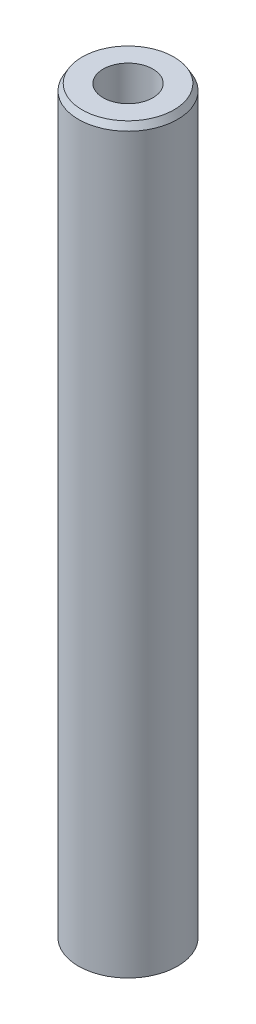
ISO-10303-21;
HEADER;
FILE_DESCRIPTION(('STEP AP214'),'2;1');
FILE_NAME('part.step','',(''),(''),'','','');
FILE_SCHEMA(('AUTOMOTIVE_DESIGN { 1 0 10303 214 1 1 1 1 }'));
ENDSEC;
DATA;
#1=APPLICATION_CONTEXT('core data for automotive mechanical design processes');
#2=APPLICATION_PROTOCOL_DEFINITION('international standard','automotive_design',2000,#1);
#3=PRODUCT_CONTEXT('',#1,'mechanical');
#4=PRODUCT('Part','Part','',(#3));
#5=PRODUCT_RELATED_PRODUCT_CATEGORY('part','',(#4));
#6=PRODUCT_DEFINITION_FORMATION('','',#4);
#7=PRODUCT_DEFINITION_CONTEXT('part definition',#1,'design');
#8=PRODUCT_DEFINITION('design','',#6,#7);
#9=PRODUCT_DEFINITION_SHAPE('','',#8);
#10=(LENGTH_UNIT() NAMED_UNIT(*) SI_UNIT(.MILLI.,.METRE.));
#11=(NAMED_UNIT(*) PLANE_ANGLE_UNIT() SI_UNIT($,.RADIAN.));
#12=(NAMED_UNIT(*) SI_UNIT($,.STERADIAN.) SOLID_ANGLE_UNIT());
#13=UNCERTAINTY_MEASURE_WITH_UNIT(LENGTH_MEASURE(1.E-05),#10,'distance_accuracy_value','');
#14=(GEOMETRIC_REPRESENTATION_CONTEXT(3) GLOBAL_UNCERTAINTY_ASSIGNED_CONTEXT((#13)) GLOBAL_UNIT_ASSIGNED_CONTEXT((#10,
#11,#12)) REPRESENTATION_CONTEXT('',''));
#15=CARTESIAN_POINT('',(0.,0.,0.));
#16=DIRECTION('',(0.,0.,1.));
#17=DIRECTION('',(1.,0.,0.));
#18=AXIS2_PLACEMENT_3D('',#15,#16,#17);
#19=CARTESIAN_POINT('',(0.,600.,0.));
#20=DIRECTION('',(0.,-1.,0.));
#21=DIRECTION('',(0.,0.,-1.));
#22=AXIS2_PLACEMENT_3D('',#19,#20,#21);
#23=CYLINDRICAL_SURFACE('',#22,40.);
#24=CARTESIAN_POINT('',(0.,594.836515759471,0.));
#25=DIRECTION('',(0.,1.,0.));
#26=DIRECTION('',(0.,0.,1.));
#27=AXIS2_PLACEMENT_3D('',#24,#25,#26);
#28=CIRCLE('',#27,40.);
#29=CARTESIAN_POINT('',(0.,594.836515759471,-40.));
#30=VERTEX_POINT('',#29);
#31=EDGE_CURVE('E50',#30,#30,#28,.F.);
#32=CARTESIAN_POINT('',(0.,2.98113901622554,0.));
#33=DIRECTION('',(0.,1.,0.));
#34=DIRECTION('',(0.,0.,1.));
#35=AXIS2_PLACEMENT_3D('',#32,#33,#34);
#36=CIRCLE('',#35,40.);
#37=CARTESIAN_POINT('',(0.,2.98113901622543,-40.));
#38=VERTEX_POINT('',#37);
#39=EDGE_CURVE('E51',#38,#38,#36,.T.);
#40=CARTESIAN_POINT('',(0.,594.836515759471,-40.));
#41=CARTESIAN_POINT('',(0.,588.671355585063,-40.));
#42=CARTESIAN_POINT('',(0.,582.506195410654,-40.));
#43=CARTESIAN_POINT('',(0.,570.175875061836,-40.));
#44=CARTESIAN_POINT('',(0.,564.010714887427,-40.));
#45=CARTESIAN_POINT('',(0.,551.68039453861,-40.));
#46=CARTESIAN_POINT('',(0.,545.515234364201,-40.));
#47=CARTESIAN_POINT('',(0.,533.184914015383,-40.));
#48=CARTESIAN_POINT('',(0.,527.019753840975,-40.));
#49=CARTESIAN_POINT('',(0.,514.689433492157,-40.));
#50=CARTESIAN_POINT('',(0.,508.524273317748,-40.));
#51=CARTESIAN_POINT('',(0.,496.19395296893,-40.));
#52=CARTESIAN_POINT('',(0.,490.028792794522,-40.));
#53=CARTESIAN_POINT('',(0.,477.698472445704,-40.));
#54=CARTESIAN_POINT('',(0.,471.533312271295,-40.));
#55=CARTESIAN_POINT('',(0.,459.202991922478,-40.));
#56=CARTESIAN_POINT('',(0.,453.037831748069,-40.));
#57=CARTESIAN_POINT('',(0.,440.707511399251,-40.));
#58=CARTESIAN_POINT('',(0.,434.542351224842,-40.));
#59=CARTESIAN_POINT('',(0.,422.212030876025,-40.));
#60=CARTESIAN_POINT('',(0.,416.046870701616,-40.));
#61=CARTESIAN_POINT('',(0.,403.716550352798,-40.));
#62=CARTESIAN_POINT('',(0.,397.551390178389,-40.));
#63=CARTESIAN_POINT('',(0.,385.221069829572,-40.));
#64=CARTESIAN_POINT('',(0.,379.055909655163,-40.));
#65=CARTESIAN_POINT('',(0.,366.725589306345,-40.));
#66=CARTESIAN_POINT('',(0.,360.560429131937,-40.));
#67=CARTESIAN_POINT('',(0.,348.230108783119,-40.));
#68=CARTESIAN_POINT('',(0.,342.06494860871,-40.));
#69=CARTESIAN_POINT('',(0.,329.734628259893,-40.));
#70=CARTESIAN_POINT('',(0.,323.569468085484,-40.));
#71=CARTESIAN_POINT('',(0.,311.239147736666,-40.));
#72=CARTESIAN_POINT('',(0.,305.073987562257,-40.));
#73=CARTESIAN_POINT('',(0.,292.74366721344,-40.));
#74=CARTESIAN_POINT('',(0.,286.578507039031,-40.));
#75=CARTESIAN_POINT('',(0.,274.248186690213,-40.));
#76=CARTESIAN_POINT('',(0.,268.083026515804,-40.));
#77=CARTESIAN_POINT('',(0.,255.752706166987,-40.));
#78=CARTESIAN_POINT('',(0.,249.587545992578,-40.));
#79=CARTESIAN_POINT('',(0.,237.25722564376,-40.));
#80=CARTESIAN_POINT('',(0.,231.092065469352,-40.));
#81=CARTESIAN_POINT('',(0.,218.761745120534,-40.));
#82=CARTESIAN_POINT('',(0.,212.596584946125,-40.));
#83=CARTESIAN_POINT('',(0.,200.266264597307,-40.));
#84=CARTESIAN_POINT('',(0.,194.101104422899,-40.));
#85=CARTESIAN_POINT('',(0.,181.770784074081,-40.));
#86=CARTESIAN_POINT('',(0.,175.605623899672,-40.));
#87=CARTESIAN_POINT('',(0.,163.275303550855,-40.));
#88=CARTESIAN_POINT('',(0.,157.110143376446,-40.));
#89=CARTESIAN_POINT('',(0.,144.779823027628,-40.));
#90=CARTESIAN_POINT('',(0.,138.614662853219,-40.));
#91=CARTESIAN_POINT('',(0.,126.284342504402,-40.));
#92=CARTESIAN_POINT('',(0.,120.119182329993,-40.));
#93=CARTESIAN_POINT('',(0.,107.788861981175,-40.));
#94=CARTESIAN_POINT('',(0.,101.623701806766,-40.));
#95=CARTESIAN_POINT('',(0.,89.2933814579489,-40.));
#96=CARTESIAN_POINT('',(0.,83.1282212835401,-40.));
#97=CARTESIAN_POINT('',(0.,70.7979009347225,-40.));
#98=CARTESIAN_POINT('',(0.,64.6327407603137,-40.));
#99=CARTESIAN_POINT('',(0.,52.302420411496,-40.));
#100=CARTESIAN_POINT('',(0.,46.1372602370872,-40.));
#101=CARTESIAN_POINT('',(0.,33.8069398882695,-40.));
#102=CARTESIAN_POINT('',(0.,27.6417797138607,-40.));
#103=CARTESIAN_POINT('',(0.,15.3114593650431,-40.));
#104=CARTESIAN_POINT('',(0.,9.14629919063425,-40.));
#105=CARTESIAN_POINT('',(0.,2.98113901622543,-40.));
#106=B_SPLINE_CURVE_WITH_KNOTS('',3,(#40,#41,#42,#43,#44,#45,#46,#47,#48,#49,#50,#51,#52,#53,
#54,#55,#56,#57,#58,#59,#60,#61,#62,#63,#64,#65,#66,#67,#68,#69,#70,#71,#72,#73,#74,#75,#76,#77,
#78,#79,#80,#81,#82,#83,#84,#85,#86,#87,#88,#89,#90,#91,#92,#93,#94,#95,#96,#97,#98,#99,#100,
#101,#102,#103,#104,#105),.UNSPECIFIED.,.F.,.F.,(4,2,2,2,2,2,2,2,2,2,2,2,2,2,2,2,2,2,2,2,2,2,2,
2,2,2,2,2,2,2,2,2,4),(0.,18.4954805232265,36.9909610464529,55.4864415696794,73.9819220929058,
92.4774026161322,110.972883139359,129.468363662585,147.963844185812,166.459324709038,
184.954805232264,203.450285755491,221.945766278717,240.441246801944,258.93672732517,
277.432207848397,295.927688371623,314.423168894849,332.918649418076,351.414129941302,
369.909610464529,388.405090987755,406.900571510982,425.396052034208,443.891532557435,
462.387013080661,480.882493603887,499.377974127114,517.87345465034,536.368935173567,
554.864415696793,573.35989622002,591.855376743246),.UNSPECIFIED.);
#107=EDGE_CURVE('BSEAM39',#30,#38,#106,.T.);
#108=ORIENTED_EDGE('',*,*,#31,.T.);
#109=ORIENTED_EDGE('',*,*,#39,.T.);
#110=ORIENTED_EDGE('',*,*,#107,.T.);
#111=ORIENTED_EDGE('',*,*,#107,.F.);
#112=EDGE_LOOP('',(#108,#110,#109,#111));
#113=FACE_BOUND('',#112,.T.);
#114=ADVANCED_FACE('F39',(#113),#23,.T.);
#115=CARTESIAN_POINT('',(0.,600.,0.));
#116=DIRECTION('',(0.,1.,0.));
#117=DIRECTION('',(0.,0.,1.));
#118=AXIS2_PLACEMENT_3D('',#115,#116,#117);
#119=PLANE('',#118);
#120=CARTESIAN_POINT('',(0.,600.,0.));
#121=DIRECTION('',(0.,1.,0.));
#122=DIRECTION('',(0.,0.,1.));
#123=AXIS2_PLACEMENT_3D('',#120,#121,#122);
#124=CIRCLE('',#123,37.0188609837746);
#125=CARTESIAN_POINT('',(0.,600.,-37.0188609837746));
#126=VERTEX_POINT('',#125);
#127=EDGE_CURVE('E54',#126,#126,#124,.T.);
#128=ORIENTED_EDGE('',*,*,#127,.T.);
#129=EDGE_LOOP('',(#128));
#130=FACE_BOUND('',#129,.T.);
#131=CARTESIAN_POINT('',(0.,600.,0.));
#132=DIRECTION('',(0.,1.,0.));
#133=DIRECTION('',(0.,0.,1.));
#134=AXIS2_PLACEMENT_3D('',#131,#132,#133);
#135=CIRCLE('',#134,20.0903469490662);
#136=CARTESIAN_POINT('',(0.,600.,20.0903469490662));
#137=VERTEX_POINT('',#136);
#138=EDGE_CURVE('E58',#137,#137,#135,.T.);
#139=ORIENTED_EDGE('',*,*,#138,.F.);
#140=EDGE_LOOP('',(#139));
#141=FACE_BOUND('',#140,.T.);
#142=ADVANCED_FACE('F69',(#130,#141),#119,.T.);
#143=CARTESIAN_POINT('',(0.,0.,0.));
#144=DIRECTION('',(0.,1.,0.));
#145=DIRECTION('',(0.,0.,1.));
#146=AXIS2_PLACEMENT_3D('',#143,#144,#145);
#147=PLANE('',#146);
#148=CARTESIAN_POINT('',(0.,0.,0.));
#149=DIRECTION('',(0.,1.,0.));
#150=DIRECTION('',(0.,0.,1.));
#151=AXIS2_PLACEMENT_3D('',#148,#149,#150);
#152=CIRCLE('',#151,34.8365157594716);
#153=CARTESIAN_POINT('',(0.,0.,34.8365157594716));
#154=VERTEX_POINT('',#153);
#155=EDGE_CURVE('E10',#154,#154,#152,.F.);
#156=ORIENTED_EDGE('',*,*,#155,.T.);
#157=EDGE_LOOP('',(#156));
#158=FACE_BOUND('',#157,.T.);
#159=CARTESIAN_POINT('',(0.,0.,0.));
#160=DIRECTION('',(0.,1.,0.));
#161=DIRECTION('',(0.,0.,1.));
#162=AXIS2_PLACEMENT_3D('',#159,#160,#161);
#163=CIRCLE('',#162,20.0903469490662);
#164=CARTESIAN_POINT('',(0.,0.,20.0903469490662));
#165=VERTEX_POINT('',#164);
#166=EDGE_CURVE('E63',#165,#165,#163,.T.);
#167=ORIENTED_EDGE('',*,*,#166,.T.);
#168=EDGE_LOOP('',(#167));
#169=FACE_BOUND('',#168,.T.);
#170=ADVANCED_FACE('F75',(#158,#169),#147,.F.);
#171=CARTESIAN_POINT('',(0.,600.,0.));
#172=DIRECTION('',(0.,-1.,0.));
#173=DIRECTION('',(0.,0.,-1.));
#174=AXIS2_PLACEMENT_3D('',#171,#172,#173);
#175=CYLINDRICAL_SURFACE('',#174,20.0903469490662);
#176=ORIENTED_EDGE('',*,*,#138,.T.);
#177=EDGE_LOOP('',(#176));
#178=FACE_BOUND('',#177,.T.);
#179=ORIENTED_EDGE('',*,*,#166,.F.);
#180=EDGE_LOOP('',(#179));
#181=FACE_BOUND('',#180,.T.);
#182=ADVANCED_FACE('F70',(#178,#181),#175,.F.);
#183=CARTESIAN_POINT('',(0.,600.,0.));
#184=DIRECTION('',(0.,-1.,0.));
#185=DIRECTION('',(0.,0.,-1.));
#186=AXIS2_PLACEMENT_3D('',#183,#184,#185);
#187=CONICAL_SURFACE('',#186,37.0188609837746,0.52359877559829);
#188=CARTESIAN_POINT('',(0.,594.836515759471,-40.));
#189=CARTESIAN_POINT('',(0.,594.890302053644,-39.968946468581));
#190=CARTESIAN_POINT('',(0.,594.944088347816,-39.937892937162));
#191=CARTESIAN_POINT('',(0.,595.05166093616,-39.875785874324));
#192=CARTESIAN_POINT('',(0.,595.105447230332,-39.844732342905));
#193=CARTESIAN_POINT('',(0.,595.213019818677,-39.7826252800669));
#194=CARTESIAN_POINT('',(0.,595.266806112849,-39.7515717486479));
#195=CARTESIAN_POINT('',(0.,595.374378701193,-39.6894646858099));
#196=CARTESIAN_POINT('',(0.,595.428164995365,-39.6584111543909));
#197=CARTESIAN_POINT('',(0.,595.53573758371,-39.5963040915528));
#198=CARTESIAN_POINT('',(0.,595.589523877882,-39.5652505601338));
#199=CARTESIAN_POINT('',(0.,595.697096466226,-39.5031434972958));
#200=CARTESIAN_POINT('',(0.,595.750882760398,-39.4720899658768));
#201=CARTESIAN_POINT('',(0.,595.858455348743,-39.4099829030388));
#202=CARTESIAN_POINT('',(0.,595.912241642915,-39.3789293716197));
#203=CARTESIAN_POINT('',(0.,596.019814231259,-39.3168223087817));
#204=CARTESIAN_POINT('',(0.,596.073600525431,-39.2857687773627));
#205=CARTESIAN_POINT('',(0.,596.181173113776,-39.2236617145246));
#206=CARTESIAN_POINT('',(0.,596.234959407948,-39.1926081831056));
#207=CARTESIAN_POINT('',(0.,596.342531996292,-39.1305011202676));
#208=CARTESIAN_POINT('',(0.,596.396318290464,-39.0994475888486));
#209=CARTESIAN_POINT('',(0.,596.503890878809,-39.0373405260106));
#210=CARTESIAN_POINT('',(0.,596.557677172981,-39.0062869945915));
#211=CARTESIAN_POINT('',(0.,596.665249761325,-38.9441799317535));
#212=CARTESIAN_POINT('',(0.,596.719036055497,-38.9131264003345));
#213=CARTESIAN_POINT('',(0.,596.826608643842,-38.8510193374965));
#214=CARTESIAN_POINT('',(0.,596.880394938014,-38.8199658060775));
#215=CARTESIAN_POINT('',(0.,596.987967526358,-38.7578587432394));
#216=CARTESIAN_POINT('',(0.,597.041753820531,-38.7268052118204));
#217=CARTESIAN_POINT('',(0.,597.149326408875,-38.6646981489824));
#218=CARTESIAN_POINT('',(0.,597.203112703047,-38.6336446175634));
#219=CARTESIAN_POINT('',(0.,597.310685291391,-38.5715375547253));
#220=CARTESIAN_POINT('',(0.,597.364471585563,-38.5404840233063));
#221=CARTESIAN_POINT('',(0.,597.472044173908,-38.4783769604683));
#222=CARTESIAN_POINT('',(0.,597.52583046808,-38.4473234290493));
#223=CARTESIAN_POINT('',(0.,597.633403056424,-38.3852163662113));
#224=CARTESIAN_POINT('',(0.,597.687189350597,-38.3541628347922));
#225=CARTESIAN_POINT('',(0.,597.794761938941,-38.2920557719542));
#226=CARTESIAN_POINT('',(0.,597.848548233113,-38.2610022405352));
#227=CARTESIAN_POINT('',(0.,597.956120821457,-38.1988951776972));
#228=CARTESIAN_POINT('',(0.,598.00990711563,-38.1678416462781));
#229=CARTESIAN_POINT('',(0.,598.117479703974,-38.1057345834401));
#230=CARTESIAN_POINT('',(0.,598.171265998146,-38.0746810520211));
#231=CARTESIAN_POINT('',(0.,598.27883858649,-38.0125739891831));
#232=CARTESIAN_POINT('',(0.,598.332624880663,-37.9815204577641));
#233=CARTESIAN_POINT('',(0.,598.440197469007,-37.919413394926));
#234=CARTESIAN_POINT('',(0.,598.493983763179,-37.888359863507));
#235=CARTESIAN_POINT('',(0.,598.601556351523,-37.826252800669));
#236=CARTESIAN_POINT('',(0.,598.655342645696,-37.79519926925));
#237=CARTESIAN_POINT('',(0.,598.76291523404,-37.7330922064119));
#238=CARTESIAN_POINT('',(0.,598.816701528212,-37.7020386749929));
#239=CARTESIAN_POINT('',(0.,598.924274116556,-37.6399316121549));
#240=CARTESIAN_POINT('',(0.,598.978060410729,-37.6088780807359));
#241=CARTESIAN_POINT('',(0.,599.085632999073,-37.5467710178978));
#242=CARTESIAN_POINT('',(0.,599.139419293245,-37.5157174864788));
#243=CARTESIAN_POINT('',(0.,599.24699188159,-37.4536104236408));
#244=CARTESIAN_POINT('',(0.,599.300778175762,-37.4225568922218));
#245=CARTESIAN_POINT('',(0.,599.408350764106,-37.3604498293837));
#246=CARTESIAN_POINT('',(0.,599.462137058278,-37.3293962979647));
#247=CARTESIAN_POINT('',(0.,599.569709646623,-37.2672892351267));
#248=CARTESIAN_POINT('',(0.,599.623495940795,-37.2362357037077));
#249=CARTESIAN_POINT('',(0.,599.731068529139,-37.1741286408696));
#250=CARTESIAN_POINT('',(0.,599.784854823311,-37.1430751094506));
#251=CARTESIAN_POINT('',(0.,599.892427411656,-37.0809680466126));
#252=CARTESIAN_POINT('',(0.,599.946213705828,-37.0499145151936));
#253=CARTESIAN_POINT('',(0.,600.,-37.0188609837746));
#254=B_SPLINE_CURVE_WITH_KNOTS('',3,(#188,#189,#190,#191,#192,#193,#194,#195,#196,#197,#198,
#199,#200,#201,#202,#203,#204,#205,#206,#207,#208,#209,#210,#211,#212,#213,#214,#215,#216,#217,
#218,#219,#220,#221,#222,#223,#224,#225,#226,#227,#228,#229,#230,#231,#232,#233,#234,#235,#236,
#237,#238,#239,#240,#241,#242,#243,#244,#245,#246,#247,#248,#249,#250,#251,#252,#253),
.UNSPECIFIED.,.F.,.F.,(4,2,2,2,2,2,2,2,2,2,2,2,2,2,2,2,2,2,2,2,2,2,2,2,2,2,2,2,2,2,2,2,4),(0.,
0.186321188514134,0.372642377028264,0.558963565542302,0.745284754056436,0.93160594257047,
1.1179271310846,1.30424831959873,1.49056950811277,1.67689069662691,1.86321188514094,
2.04953307365507,2.23585426216921,2.42217545068324,2.60849663919738,2.79481782771141,
2.98113901622555,3.16746020473968,3.35378139325371,3.54010258176785,3.72642377028188,
3.91274495879602,4.09906614731015,4.28538733582418,4.47170852433832,4.65802971285235,
4.84435090136649,5.03067208988062,5.21699327839465,5.40331446690879,5.58963565542282,
5.77595684393695,5.96227803245108),.UNSPECIFIED.);
#255=EDGE_CURVE('BSEAM81',#30,#126,#254,.T.);
#256=ORIENTED_EDGE('',*,*,#31,.F.);
#257=ORIENTED_EDGE('',*,*,#127,.F.);
#258=ORIENTED_EDGE('',*,*,#255,.T.);
#259=ORIENTED_EDGE('',*,*,#255,.F.);
#260=EDGE_LOOP('',(#256,#258,#257,#259));
#261=FACE_BOUND('',#260,.T.);
#262=ADVANCED_FACE('F81',(#261),#187,.T.);
#263=CARTESIAN_POINT('',(0.,2.98113901622554,0.));
#264=DIRECTION('',(0.,1.,0.));
#265=DIRECTION('',(0.,0.,1.));
#266=AXIS2_PLACEMENT_3D('',#263,#264,#265);
#267=CONICAL_SURFACE('',#266,40.,1.04719755119659);
#268=ORIENTED_EDGE('',*,*,#155,.F.);
#269=EDGE_LOOP('',(#268));
#270=FACE_BOUND('',#269,.T.);
#271=ORIENTED_EDGE('',*,*,#39,.F.);
#272=EDGE_LOOP('',(#271));
#273=FACE_BOUND('',#272,.T.);
#274=ADVANCED_FACE('F45',(#270,#273),#267,.T.);
#275=CLOSED_SHELL('',(#114,#142,#170,#182,#262,#274));
#276=MANIFOLD_SOLID_BREP('B2',#275);
#277=ADVANCED_BREP_SHAPE_REPRESENTATION('',(#18,#276),#14);
#278=SHAPE_DEFINITION_REPRESENTATION(#9,#277);
ENDSEC;
END-ISO-10303-21;
